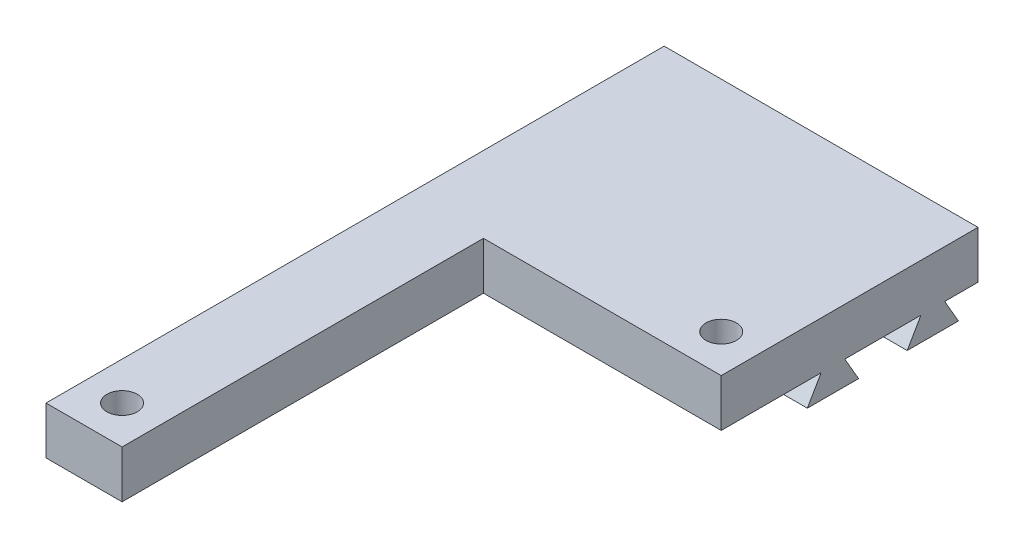
ISO-10303-21;
HEADER;
FILE_DESCRIPTION(('STEP AP214'),'2;1');
FILE_NAME('part.step','',(''),(''),'','','');
FILE_SCHEMA(('AUTOMOTIVE_DESIGN { 1 0 10303 214 1 1 1 1 }'));
ENDSEC;
DATA;
#1=APPLICATION_CONTEXT('core data for automotive mechanical design processes');
#2=APPLICATION_PROTOCOL_DEFINITION('international standard','automotive_design',2000,#1);
#3=PRODUCT_CONTEXT('',#1,'mechanical');
#4=PRODUCT('Part','Part','',(#3));
#5=PRODUCT_RELATED_PRODUCT_CATEGORY('part','',(#4));
#6=PRODUCT_DEFINITION_FORMATION('','',#4);
#7=PRODUCT_DEFINITION_CONTEXT('part definition',#1,'design');
#8=PRODUCT_DEFINITION('design','',#6,#7);
#9=PRODUCT_DEFINITION_SHAPE('','',#8);
#10=(LENGTH_UNIT() NAMED_UNIT(*) SI_UNIT(.MILLI.,.METRE.));
#11=(NAMED_UNIT(*) PLANE_ANGLE_UNIT() SI_UNIT($,.RADIAN.));
#12=(NAMED_UNIT(*) SI_UNIT($,.STERADIAN.) SOLID_ANGLE_UNIT());
#13=UNCERTAINTY_MEASURE_WITH_UNIT(LENGTH_MEASURE(1.E-05),#10,'distance_accuracy_value','');
#14=(GEOMETRIC_REPRESENTATION_CONTEXT(3) GLOBAL_UNCERTAINTY_ASSIGNED_CONTEXT((#13)) GLOBAL_UNIT_ASSIGNED_CONTEXT((#10,
#11,#12)) REPRESENTATION_CONTEXT('',''));
#15=CARTESIAN_POINT('',(0.,0.,0.));
#16=DIRECTION('',(0.,0.,1.));
#17=DIRECTION('',(1.,0.,0.));
#18=AXIS2_PLACEMENT_3D('',#15,#16,#17);
#19=CARTESIAN_POINT('',(0.,0.,0.));
#20=DIRECTION('',(0.,1.,0.));
#21=DIRECTION('',(0.,0.,1.));
#22=AXIS2_PLACEMENT_3D('',#19,#20,#21);
#23=PLANE('',#22);
#24=DIRECTION('',(0.,0.,-1.));
#25=VECTOR('',#24,1.);
#26=CARTESIAN_POINT('',(-16.5,0.,0.));
#27=LINE('',#26,#25);
#28=CARTESIAN_POINT('',(-16.5,0.,-16.));
#29=VERTEX_POINT('',#28);
#30=CARTESIAN_POINT('',(-16.5,0.,-24.));
#31=VERTEX_POINT('',#30);
#32=EDGE_CURVE('E158',#29,#31,#27,.T.);
#33=ORIENTED_EDGE('',*,*,#32,.T.);
#34=DIRECTION('',(1.,0.,0.));
#35=VECTOR('',#34,1.);
#36=CARTESIAN_POINT('',(-16.5,0.,-24.));
#37=LINE('',#36,#35);
#38=CARTESIAN_POINT('',(16.5,0.,-24.));
#39=VERTEX_POINT('',#38);
#40=EDGE_CURVE('E65',#31,#39,#37,.T.);
#41=ORIENTED_EDGE('',*,*,#40,.T.);
#42=DIRECTION('',(0.,0.,-1.));
#43=VECTOR('',#42,1.);
#44=CARTESIAN_POINT('',(16.5,0.,0.));
#45=LINE('',#44,#43);
#46=CARTESIAN_POINT('',(16.5,0.,-16.));
#47=VERTEX_POINT('',#46);
#48=EDGE_CURVE('E293',#47,#39,#45,.T.);
#49=ORIENTED_EDGE('',*,*,#48,.F.);
#50=DIRECTION('',(1.,0.,0.));
#51=VECTOR('',#50,1.);
#52=CARTESIAN_POINT('',(-16.5,0.,-16.));
#53=LINE('',#52,#51);
#54=EDGE_CURVE('E252',#29,#47,#53,.T.);
#55=ORIENTED_EDGE('',*,*,#54,.F.);
#56=EDGE_LOOP('',(#33,#41,#49,#55));
#57=FACE_BOUND('',#56,.T.);
#58=ADVANCED_FACE('F41',(#57),#23,.F.);
#59=CARTESIAN_POINT('',(16.5,0.,-26.5));
#60=VERTEX_POINT('',#59);
#61=CARTESIAN_POINT('',(16.5,0.,-30.));
#62=VERTEX_POINT('',#61);
#63=EDGE_CURVE('E57',#60,#62,#45,.T.);
#64=ORIENTED_EDGE('',*,*,#63,.F.);
#65=DIRECTION('',(1.,0.,0.));
#66=VECTOR('',#65,1.);
#67=CARTESIAN_POINT('',(-16.5,0.,-26.5));
#68=LINE('',#67,#66);
#69=CARTESIAN_POINT('',(-16.5,0.,-26.5));
#70=VERTEX_POINT('',#69);
#71=EDGE_CURVE('E213',#70,#60,#68,.T.);
#72=ORIENTED_EDGE('',*,*,#71,.F.);
#73=CARTESIAN_POINT('',(-16.5,0.,-30.));
#74=VERTEX_POINT('',#73);
#75=EDGE_CURVE('E160',#70,#74,#27,.T.);
#76=ORIENTED_EDGE('',*,*,#75,.T.);
#77=DIRECTION('',(1.,0.,0.));
#78=VECTOR('',#77,1.);
#79=CARTESIAN_POINT('',(0.,0.,-30.));
#80=LINE('',#79,#78);
#81=EDGE_CURVE('E292',#74,#62,#80,.T.);
#82=ORIENTED_EDGE('',*,*,#81,.T.);
#83=EDGE_LOOP('',(#64,#72,#76,#82));
#84=FACE_BOUND('',#83,.T.);
#85=ADVANCED_FACE('F303',(#84),#23,.F.);
#86=CARTESIAN_POINT('',(-8.49999999999999,5.,0.));
#87=DIRECTION('',(1.,0.,0.));
#88=DIRECTION('',(0.,0.,-1.));
#89=AXIS2_PLACEMENT_3D('',#86,#87,#88);
#90=PLANE('',#89);
#91=DIRECTION('',(0.,-1.,0.));
#92=VECTOR('',#91,1.);
#93=CARTESIAN_POINT('',(-8.49999999999999,5.,-2.99999999999999));
#94=LINE('',#93,#92);
#95=CARTESIAN_POINT('',(-8.49999999999999,5.,-2.99999999999999));
#96=VERTEX_POINT('',#95);
#97=CARTESIAN_POINT('',(-8.49999999999999,0.,-2.99999999999999));
#98=VERTEX_POINT('',#97);
#99=EDGE_CURVE('E191',#96,#98,#94,.T.);
#100=ORIENTED_EDGE('',*,*,#99,.F.);
#101=DIRECTION('',(0.,0.,1.));
#102=VECTOR('',#101,1.);
#103=CARTESIAN_POINT('',(-8.49999999999999,5.,0.));
#104=LINE('',#103,#102);
#105=CARTESIAN_POINT('',(-8.49999999999999,5.,35.));
#106=VERTEX_POINT('',#105);
#107=EDGE_CURVE('E157',#96,#106,#104,.T.);
#108=ORIENTED_EDGE('',*,*,#107,.T.);
#109=DIRECTION('',(0.,1.,0.));
#110=VECTOR('',#109,1.);
#111=CARTESIAN_POINT('',(-8.49999999999999,5.,35.));
#112=LINE('',#111,#110);
#113=CARTESIAN_POINT('',(-8.49999999999999,0.,35.));
#114=VERTEX_POINT('',#113);
#115=EDGE_CURVE('E170',#114,#106,#112,.T.);
#116=ORIENTED_EDGE('',*,*,#115,.F.);
#117=DIRECTION('',(0.,0.,1.));
#118=VECTOR('',#117,1.);
#119=CARTESIAN_POINT('',(-8.49999999999999,0.,0.));
#120=LINE('',#119,#118);
#121=EDGE_CURVE('E165',#98,#114,#120,.T.);
#122=ORIENTED_EDGE('',*,*,#121,.F.);
#123=EDGE_LOOP('',(#100,#108,#116,#122));
#124=FACE_BOUND('',#123,.T.);
#125=ADVANCED_FACE('F43',(#124),#90,.T.);
#126=CARTESIAN_POINT('',(16.5,5.,0.));
#127=DIRECTION('',(-1.,0.,0.));
#128=DIRECTION('',(0.,0.,1.));
#129=AXIS2_PLACEMENT_3D('',#126,#127,#128);
#130=PLANE('',#129);
#131=CARTESIAN_POINT('',(16.5,0.,-2.99999999999999));
#132=VERTEX_POINT('',#131);
#133=CARTESIAN_POINT('',(16.5,0.,-13.5));
#134=VERTEX_POINT('',#133);
#135=EDGE_CURVE('E288',#132,#134,#45,.T.);
#136=ORIENTED_EDGE('',*,*,#135,.T.);
#137=DIRECTION('',(0.,0.866025403784436,-0.500000000000005));
#138=VECTOR('',#137,1.);
#139=CARTESIAN_POINT('',(16.5,-5.84567147554499,-10.1249999999999));
#140=LINE('',#139,#138);
#141=CARTESIAN_POINT('',(16.5,-2.5,-12.0566243270259));
#142=VERTEX_POINT('',#141);
#143=EDGE_CURVE('E256',#142,#134,#140,.T.);
#144=ORIENTED_EDGE('',*,*,#143,.F.);
#145=DIRECTION('',(0.,0.,1.));
#146=VECTOR('',#145,1.);
#147=CARTESIAN_POINT('',(16.5,-2.5,0.));
#148=LINE('',#147,#146);
#149=CARTESIAN_POINT('',(16.5,-2.5,-17.4433756729741));
#150=VERTEX_POINT('',#149);
#151=EDGE_CURVE('E246',#150,#142,#148,.T.);
#152=ORIENTED_EDGE('',*,*,#151,.F.);
#153=DIRECTION('',(0.,-0.866025403784436,-0.500000000000004));
#154=VECTOR('',#153,1.);
#155=CARTESIAN_POINT('',(16.5,6.92820323027554,-11.9999999999999));
#156=LINE('',#155,#154);
#157=EDGE_CURVE('E231',#47,#150,#156,.T.);
#158=ORIENTED_EDGE('',*,*,#157,.F.);
#159=ORIENTED_EDGE('',*,*,#48,.T.);
#160=DIRECTION('',(0.,-0.866025403784436,0.500000000000004));
#161=VECTOR('',#160,1.);
#162=CARTESIAN_POINT('',(16.5,0.,-24.));
#163=LINE('',#162,#161);
#164=CARTESIAN_POINT('',(16.5,-2.5,-22.5566243270259));
#165=VERTEX_POINT('',#164);
#166=EDGE_CURVE('E227',#39,#165,#163,.T.);
#167=ORIENTED_EDGE('',*,*,#166,.T.);
#168=DIRECTION('',(0.,0.,-1.));
#169=VECTOR('',#168,1.);
#170=CARTESIAN_POINT('',(16.5,-2.5,-22.5566243270259));
#171=LINE('',#170,#169);
#172=CARTESIAN_POINT('',(16.5,-2.5,-27.9433756729741));
#173=VERTEX_POINT('',#172);
#174=EDGE_CURVE('E222',#165,#173,#171,.T.);
#175=ORIENTED_EDGE('',*,*,#174,.T.);
#176=DIRECTION('',(0.,0.866025403784436,0.500000000000005));
#177=VECTOR('',#176,1.);
#178=CARTESIAN_POINT('',(16.5,-2.5,-27.9433756729741));
#179=LINE('',#178,#177);
#180=EDGE_CURVE('E218',#173,#60,#179,.T.);
#181=ORIENTED_EDGE('',*,*,#180,.T.);
#182=ORIENTED_EDGE('',*,*,#63,.T.);
#183=DIRECTION('',(0.,-1.,0.));
#184=VECTOR('',#183,1.);
#185=CARTESIAN_POINT('',(16.5,5.,-30.));
#186=LINE('',#185,#184);
#187=CARTESIAN_POINT('',(16.5,5.,-30.));
#188=VERTEX_POINT('',#187);
#189=EDGE_CURVE('E11',#188,#62,#186,.T.);
#190=ORIENTED_EDGE('',*,*,#189,.F.);
#191=DIRECTION('',(0.,0.,-1.));
#192=VECTOR('',#191,1.);
#193=CARTESIAN_POINT('',(16.5,5.,0.));
#194=LINE('',#193,#192);
#195=CARTESIAN_POINT('',(16.5,5.,-2.99999999999999));
#196=VERTEX_POINT('',#195);
#197=EDGE_CURVE('E276',#196,#188,#194,.T.);
#198=ORIENTED_EDGE('',*,*,#197,.F.);
#199=DIRECTION('',(0.,1.,0.));
#200=VECTOR('',#199,1.);
#201=CARTESIAN_POINT('',(16.5,5.,-2.99999999999999));
#202=LINE('',#201,#200);
#203=EDGE_CURVE('E199',#132,#196,#202,.T.);
#204=ORIENTED_EDGE('',*,*,#203,.F.);
#205=EDGE_LOOP('',(#136,#144,#152,#158,#159,#167,#175,#181,#182,#190,#198,#204));
#206=FACE_BOUND('',#205,.T.);
#207=ADVANCED_FACE('F318',(#206),#130,.F.);
#208=CARTESIAN_POINT('',(0.,5.,-30.));
#209=DIRECTION('',(0.,0.,-1.));
#210=DIRECTION('',(-1.,0.,0.));
#211=AXIS2_PLACEMENT_3D('',#208,#209,#210);
#212=PLANE('',#211);
#213=ORIENTED_EDGE('',*,*,#81,.F.);
#214=DIRECTION('',(0.,-1.,0.));
#215=VECTOR('',#214,1.);
#216=CARTESIAN_POINT('',(-16.5,5.,-30.));
#217=LINE('',#216,#215);
#218=CARTESIAN_POINT('',(-16.5,5.,-30.));
#219=VERTEX_POINT('',#218);
#220=EDGE_CURVE('E50',#219,#74,#217,.T.);
#221=ORIENTED_EDGE('',*,*,#220,.F.);
#222=DIRECTION('',(1.,0.,0.));
#223=VECTOR('',#222,1.);
#224=CARTESIAN_POINT('',(0.,5.,-30.));
#225=LINE('',#224,#223);
#226=EDGE_CURVE('E279',#219,#188,#225,.T.);
#227=ORIENTED_EDGE('',*,*,#226,.T.);
#228=ORIENTED_EDGE('',*,*,#189,.T.);
#229=EDGE_LOOP('',(#213,#221,#227,#228));
#230=FACE_BOUND('',#229,.T.);
#231=ADVANCED_FACE('F301',(#230),#212,.T.);
#232=CARTESIAN_POINT('',(-16.5,5.,0.));
#233=DIRECTION('',(-1.,0.,0.));
#234=DIRECTION('',(0.,0.,1.));
#235=AXIS2_PLACEMENT_3D('',#232,#233,#234);
#236=PLANE('',#235);
#237=CARTESIAN_POINT('',(-16.5,0.,35.));
#238=VERTEX_POINT('',#237);
#239=CARTESIAN_POINT('',(-16.5,0.,-13.5));
#240=VERTEX_POINT('',#239);
#241=EDGE_CURVE('E145',#238,#240,#27,.T.);
#242=ORIENTED_EDGE('',*,*,#241,.F.);
#243=DIRECTION('',(0.,-1.,0.));
#244=VECTOR('',#243,1.);
#245=CARTESIAN_POINT('',(-16.5,5.,35.));
#246=LINE('',#245,#244);
#247=CARTESIAN_POINT('',(-16.5,5.,35.));
#248=VERTEX_POINT('',#247);
#249=EDGE_CURVE('E150',#248,#238,#246,.T.);
#250=ORIENTED_EDGE('',*,*,#249,.F.);
#251=DIRECTION('',(0.,0.,-1.));
#252=VECTOR('',#251,1.);
#253=CARTESIAN_POINT('',(-16.5,5.,0.));
#254=LINE('',#253,#252);
#255=EDGE_CURVE('E283',#248,#219,#254,.T.);
#256=ORIENTED_EDGE('',*,*,#255,.T.);
#257=ORIENTED_EDGE('',*,*,#220,.T.);
#258=ORIENTED_EDGE('',*,*,#75,.F.);
#259=DIRECTION('',(0.,0.866025403784436,0.500000000000005));
#260=VECTOR('',#259,1.);
#261=CARTESIAN_POINT('',(-16.5,-2.5,-27.9433756729741));
#262=LINE('',#261,#260);
#263=CARTESIAN_POINT('',(-16.5,-2.5,-27.9433756729741));
#264=VERTEX_POINT('',#263);
#265=EDGE_CURVE('E209',#264,#70,#262,.T.);
#266=ORIENTED_EDGE('',*,*,#265,.F.);
#267=DIRECTION('',(0.,0.,-1.));
#268=VECTOR('',#267,1.);
#269=CARTESIAN_POINT('',(-16.5,-2.5,-22.5566243270259));
#270=LINE('',#269,#268);
#271=CARTESIAN_POINT('',(-16.5,-2.5,-22.5566243270259));
#272=VERTEX_POINT('',#271);
#273=EDGE_CURVE('E235',#272,#264,#270,.T.);
#274=ORIENTED_EDGE('',*,*,#273,.F.);
#275=DIRECTION('',(0.,-0.866025403784436,0.500000000000004));
#276=VECTOR('',#275,1.);
#277=CARTESIAN_POINT('',(-16.5,0.,-24.));
#278=LINE('',#277,#276);
#279=EDGE_CURVE('E223',#31,#272,#278,.T.);
#280=ORIENTED_EDGE('',*,*,#279,.F.);
#281=ORIENTED_EDGE('',*,*,#32,.F.);
#282=DIRECTION('',(0.,-0.866025403784436,-0.500000000000004));
#283=VECTOR('',#282,1.);
#284=CARTESIAN_POINT('',(-16.5,6.92820323027554,-11.9999999999999));
#285=LINE('',#284,#283);
#286=CARTESIAN_POINT('',(-16.5,-2.5,-17.4433756729741));
#287=VERTEX_POINT('',#286);
#288=EDGE_CURVE('E242',#29,#287,#285,.T.);
#289=ORIENTED_EDGE('',*,*,#288,.T.);
#290=DIRECTION('',(0.,0.,1.));
#291=VECTOR('',#290,1.);
#292=CARTESIAN_POINT('',(-16.5,-2.5,0.));
#293=LINE('',#292,#291);
#294=CARTESIAN_POINT('',(-16.5,-2.5,-12.0566243270259));
#295=VERTEX_POINT('',#294);
#296=EDGE_CURVE('E249',#287,#295,#293,.T.);
#297=ORIENTED_EDGE('',*,*,#296,.T.);
#298=DIRECTION('',(0.,0.866025403784436,-0.500000000000005));
#299=VECTOR('',#298,1.);
#300=CARTESIAN_POINT('',(-16.5,-5.84567147554499,-10.1249999999999));
#301=LINE('',#300,#299);
#302=EDGE_CURVE('E152',#295,#240,#301,.T.);
#303=ORIENTED_EDGE('',*,*,#302,.T.);
#304=EDGE_LOOP('',(#242,#250,#256,#257,#258,#266,#274,#280,#281,#289,#297,#303));
#305=FACE_BOUND('',#304,.T.);
#306=ADVANCED_FACE('F147',(#305),#236,.T.);
#307=CARTESIAN_POINT('',(0.,5.,0.));
#308=DIRECTION('',(0.,1.,0.));
#309=DIRECTION('',(0.,0.,1.));
#310=AXIS2_PLACEMENT_3D('',#307,#308,#309);
#311=PLANE('',#310);
#312=CARTESIAN_POINT('',(12.5,5.,-6.99999999999999));
#313=DIRECTION('',(0.,1.,0.));
#314=DIRECTION('',(0.,0.,1.));
#315=AXIS2_PLACEMENT_3D('',#312,#313,#314);
#316=CIRCLE('',#315,1.6);
#317=CARTESIAN_POINT('',(12.5,5.,-5.39999999999999));
#318=VERTEX_POINT('',#317);
#319=EDGE_CURVE('E181',#318,#318,#316,.T.);
#320=ORIENTED_EDGE('',*,*,#319,.F.);
#321=EDGE_LOOP('',(#320));
#322=FACE_BOUND('',#321,.T.);
#323=CARTESIAN_POINT('',(-12.5,5.,31.));
#324=DIRECTION('',(0.,1.,0.));
#325=DIRECTION('',(0.,0.,1.));
#326=AXIS2_PLACEMENT_3D('',#323,#324,#325);
#327=CIRCLE('',#326,1.6);
#328=CARTESIAN_POINT('',(-12.5,5.,32.6));
#329=VERTEX_POINT('',#328);
#330=EDGE_CURVE('E184',#329,#329,#327,.T.);
#331=ORIENTED_EDGE('',*,*,#330,.F.);
#332=EDGE_LOOP('',(#331));
#333=FACE_BOUND('',#332,.T.);
#334=ORIENTED_EDGE('',*,*,#107,.F.);
#335=DIRECTION('',(-1.,0.,0.));
#336=VECTOR('',#335,1.);
#337=CARTESIAN_POINT('',(-8.49999999999999,5.,-2.99999999999999));
#338=LINE('',#337,#336);
#339=EDGE_CURVE('E203',#196,#96,#338,.T.);
#340=ORIENTED_EDGE('',*,*,#339,.F.);
#341=ORIENTED_EDGE('',*,*,#197,.T.);
#342=ORIENTED_EDGE('',*,*,#226,.F.);
#343=ORIENTED_EDGE('',*,*,#255,.F.);
#344=DIRECTION('',(-1.,0.,0.));
#345=VECTOR('',#344,1.);
#346=CARTESIAN_POINT('',(-16.5,5.,35.));
#347=LINE('',#346,#345);
#348=EDGE_CURVE('E175',#106,#248,#347,.T.);
#349=ORIENTED_EDGE('',*,*,#348,.F.);
#350=EDGE_LOOP('',(#334,#340,#341,#342,#343,#349));
#351=FACE_BOUND('',#350,.T.);
#352=ADVANCED_FACE('F344',(#322,#333,#351),#311,.T.);
#353=CARTESIAN_POINT('',(12.5,0.,-6.99999999999999));
#354=DIRECTION('',(0.,1.,0.));
#355=DIRECTION('',(0.,0.,1.));
#356=AXIS2_PLACEMENT_3D('',#353,#354,#355);
#357=CIRCLE('',#356,1.6);
#358=CARTESIAN_POINT('',(12.5,0.,-5.39999999999999));
#359=VERTEX_POINT('',#358);
#360=EDGE_CURVE('E177',#359,#359,#357,.T.);
#361=ORIENTED_EDGE('',*,*,#360,.T.);
#362=EDGE_LOOP('',(#361));
#363=FACE_BOUND('',#362,.T.);
#364=CARTESIAN_POINT('',(-12.5,0.,31.));
#365=DIRECTION('',(0.,1.,0.));
#366=DIRECTION('',(0.,0.,1.));
#367=AXIS2_PLACEMENT_3D('',#364,#365,#366);
#368=CIRCLE('',#367,1.6);
#369=CARTESIAN_POINT('',(-12.5,0.,32.6));
#370=VERTEX_POINT('',#369);
#371=EDGE_CURVE('E358',#370,#370,#368,.T.);
#372=ORIENTED_EDGE('',*,*,#371,.T.);
#373=EDGE_LOOP('',(#372));
#374=FACE_BOUND('',#373,.T.);
#375=DIRECTION('',(1.,0.,0.));
#376=VECTOR('',#375,1.);
#377=CARTESIAN_POINT('',(-8.49999999999999,0.,-2.99999999999999));
#378=LINE('',#377,#376);
#379=EDGE_CURVE('E195',#98,#132,#378,.T.);
#380=ORIENTED_EDGE('',*,*,#379,.F.);
#381=ORIENTED_EDGE('',*,*,#121,.T.);
#382=DIRECTION('',(1.,0.,0.));
#383=VECTOR('',#382,1.);
#384=CARTESIAN_POINT('',(-16.5,0.,35.));
#385=LINE('',#384,#383);
#386=EDGE_CURVE('E162',#238,#114,#385,.T.);
#387=ORIENTED_EDGE('',*,*,#386,.F.);
#388=ORIENTED_EDGE('',*,*,#241,.T.);
#389=DIRECTION('',(1.,0.,0.));
#390=VECTOR('',#389,1.);
#391=CARTESIAN_POINT('',(-16.5,0.,-13.5));
#392=LINE('',#391,#390);
#393=EDGE_CURVE('E269',#240,#134,#392,.T.);
#394=ORIENTED_EDGE('',*,*,#393,.T.);
#395=ORIENTED_EDGE('',*,*,#135,.F.);
#396=EDGE_LOOP('',(#380,#381,#387,#388,#394,#395));
#397=FACE_BOUND('',#396,.T.);
#398=ADVANCED_FACE('F163',(#363,#374,#397),#23,.F.);
#399=CARTESIAN_POINT('',(-16.5,6.92820323027554,-11.9999999999999));
#400=DIRECTION('',(0.,-0.500000000000004,0.866025403784436));
#401=DIRECTION('',(0.,-0.866025403784436,-0.500000000000004));
#402=AXIS2_PLACEMENT_3D('',#399,#400,#401);
#403=PLANE('',#402);
#404=ORIENTED_EDGE('',*,*,#157,.T.);
#405=DIRECTION('',(1.,0.,0.));
#406=VECTOR('',#405,1.);
#407=CARTESIAN_POINT('',(-16.5,-2.5,-17.4433756729741));
#408=LINE('',#407,#406);
#409=EDGE_CURVE('E261',#287,#150,#408,.T.);
#410=ORIENTED_EDGE('',*,*,#409,.F.);
#411=ORIENTED_EDGE('',*,*,#288,.F.);
#412=ORIENTED_EDGE('',*,*,#54,.T.);
#413=EDGE_LOOP('',(#404,#410,#411,#412));
#414=FACE_BOUND('',#413,.T.);
#415=ADVANCED_FACE('F343',(#414),#403,.F.);
#416=CARTESIAN_POINT('',(-16.5,-2.5,0.));
#417=DIRECTION('',(0.,1.,0.));
#418=DIRECTION('',(0.,0.,1.));
#419=AXIS2_PLACEMENT_3D('',#416,#417,#418);
#420=PLANE('',#419);
#421=ORIENTED_EDGE('',*,*,#151,.T.);
#422=DIRECTION('',(1.,0.,0.));
#423=VECTOR('',#422,1.);
#424=CARTESIAN_POINT('',(-16.5,-2.5,-12.0566243270259));
#425=LINE('',#424,#423);
#426=EDGE_CURVE('E265',#295,#142,#425,.T.);
#427=ORIENTED_EDGE('',*,*,#426,.F.);
#428=ORIENTED_EDGE('',*,*,#296,.F.);
#429=ORIENTED_EDGE('',*,*,#409,.T.);
#430=EDGE_LOOP('',(#421,#427,#428,#429));
#431=FACE_BOUND('',#430,.T.);
#432=ADVANCED_FACE('F350',(#431),#420,.F.);
#433=CARTESIAN_POINT('',(-16.5,-5.84567147554499,-10.1249999999999));
#434=DIRECTION('',(0.,-0.500000000000005,-0.866025403784436));
#435=DIRECTION('',(0.,0.866025403784436,-0.500000000000005));
#436=AXIS2_PLACEMENT_3D('',#433,#434,#435);
#437=PLANE('',#436);
#438=ORIENTED_EDGE('',*,*,#143,.T.);
#439=ORIENTED_EDGE('',*,*,#393,.F.);
#440=ORIENTED_EDGE('',*,*,#302,.F.);
#441=ORIENTED_EDGE('',*,*,#426,.T.);
#442=EDGE_LOOP('',(#438,#439,#440,#441));
#443=FACE_BOUND('',#442,.T.);
#444=ADVANCED_FACE('F332',(#443),#437,.F.);
#445=CARTESIAN_POINT('',(-16.5,0.,-24.));
#446=DIRECTION('',(0.,0.500000000000004,0.866025403784436));
#447=DIRECTION('',(0.,-0.866025403784437,0.500000000000004));
#448=AXIS2_PLACEMENT_3D('',#445,#446,#447);
#449=PLANE('',#448);
#450=ORIENTED_EDGE('',*,*,#166,.F.);
#451=ORIENTED_EDGE('',*,*,#40,.F.);
#452=ORIENTED_EDGE('',*,*,#279,.T.);
#453=DIRECTION('',(1.,0.,0.));
#454=VECTOR('',#453,1.);
#455=CARTESIAN_POINT('',(-16.5,-2.5,-22.5566243270259));
#456=LINE('',#455,#454);
#457=EDGE_CURVE('E206',#272,#165,#456,.T.);
#458=ORIENTED_EDGE('',*,*,#457,.T.);
#459=EDGE_LOOP('',(#450,#451,#452,#458));
#460=FACE_BOUND('',#459,.T.);
#461=ADVANCED_FACE('F311',(#460),#449,.T.);
#462=CARTESIAN_POINT('',(-16.5,-2.5,-27.9433756729741));
#463=DIRECTION('',(0.,0.500000000000005,-0.866025403784436));
#464=DIRECTION('',(0.,0.866025403784436,0.500000000000005));
#465=AXIS2_PLACEMENT_3D('',#462,#463,#464);
#466=PLANE('',#465);
#467=ORIENTED_EDGE('',*,*,#180,.F.);
#468=DIRECTION('',(1.,0.,0.));
#469=VECTOR('',#468,1.);
#470=CARTESIAN_POINT('',(-16.5,-2.5,-27.9433756729741));
#471=LINE('',#470,#469);
#472=EDGE_CURVE('E210',#264,#173,#471,.T.);
#473=ORIENTED_EDGE('',*,*,#472,.F.);
#474=ORIENTED_EDGE('',*,*,#265,.T.);
#475=ORIENTED_EDGE('',*,*,#71,.T.);
#476=EDGE_LOOP('',(#467,#473,#474,#475));
#477=FACE_BOUND('',#476,.T.);
#478=ADVANCED_FACE('F323',(#477),#466,.T.);
#479=CARTESIAN_POINT('',(-16.5,-2.5,-22.5566243270259));
#480=DIRECTION('',(0.,-1.,0.));
#481=DIRECTION('',(0.,0.,-1.));
#482=AXIS2_PLACEMENT_3D('',#479,#480,#481);
#483=PLANE('',#482);
#484=ORIENTED_EDGE('',*,*,#174,.F.);
#485=ORIENTED_EDGE('',*,*,#457,.F.);
#486=ORIENTED_EDGE('',*,*,#273,.T.);
#487=ORIENTED_EDGE('',*,*,#472,.T.);
#488=EDGE_LOOP('',(#484,#485,#486,#487));
#489=FACE_BOUND('',#488,.T.);
#490=ADVANCED_FACE('F315',(#489),#483,.T.);
#491=CARTESIAN_POINT('',(0.,0.,-2.99999999999999));
#492=DIRECTION('',(0.,0.,1.));
#493=DIRECTION('',(1.,0.,0.));
#494=AXIS2_PLACEMENT_3D('',#491,#492,#493);
#495=PLANE('',#494);
#496=ORIENTED_EDGE('',*,*,#99,.T.);
#497=ORIENTED_EDGE('',*,*,#379,.T.);
#498=ORIENTED_EDGE('',*,*,#203,.T.);
#499=ORIENTED_EDGE('',*,*,#339,.T.);
#500=EDGE_LOOP('',(#496,#497,#498,#499));
#501=FACE_BOUND('',#500,.T.);
#502=ADVANCED_FACE('F330',(#501),#495,.T.);
#503=CARTESIAN_POINT('',(0.,0.,35.));
#504=DIRECTION('',(0.,0.,1.));
#505=DIRECTION('',(1.,0.,0.));
#506=AXIS2_PLACEMENT_3D('',#503,#504,#505);
#507=PLANE('',#506);
#508=ORIENTED_EDGE('',*,*,#249,.T.);
#509=ORIENTED_EDGE('',*,*,#386,.T.);
#510=ORIENTED_EDGE('',*,*,#115,.T.);
#511=ORIENTED_EDGE('',*,*,#348,.T.);
#512=EDGE_LOOP('',(#508,#509,#510,#511));
#513=FACE_BOUND('',#512,.T.);
#514=ADVANCED_FACE('F173',(#513),#507,.T.);
#515=CARTESIAN_POINT('',(-12.5,0.,31.));
#516=DIRECTION('',(0.,1.,0.));
#517=DIRECTION('',(0.,0.,1.));
#518=AXIS2_PLACEMENT_3D('',#515,#516,#517);
#519=CYLINDRICAL_SURFACE('',#518,1.6);
#520=ORIENTED_EDGE('',*,*,#371,.F.);
#521=EDGE_LOOP('',(#520));
#522=FACE_BOUND('',#521,.T.);
#523=ORIENTED_EDGE('',*,*,#330,.T.);
#524=EDGE_LOOP('',(#523));
#525=FACE_BOUND('',#524,.T.);
#526=ADVANCED_FACE('F368',(#522,#525),#519,.F.);
#527=CARTESIAN_POINT('',(12.5,0.,-6.99999999999999));
#528=DIRECTION('',(0.,1.,0.));
#529=DIRECTION('',(0.,0.,1.));
#530=AXIS2_PLACEMENT_3D('',#527,#528,#529);
#531=CYLINDRICAL_SURFACE('',#530,1.6);
#532=ORIENTED_EDGE('',*,*,#360,.F.);
#533=EDGE_LOOP('',(#532));
#534=FACE_BOUND('',#533,.T.);
#535=ORIENTED_EDGE('',*,*,#319,.T.);
#536=EDGE_LOOP('',(#535));
#537=FACE_BOUND('',#536,.T.);
#538=ADVANCED_FACE('F465',(#534,#537),#531,.F.);
#539=CLOSED_SHELL('',(#58,#85,#125,#207,#231,#306,#352,#398,#415,#432,#444,#461,#478,#490,#502,
#514,#526,#538));
#540=MANIFOLD_SOLID_BREP('B2',#539);
#541=ADVANCED_BREP_SHAPE_REPRESENTATION('',(#18,#540),#14);
#542=SHAPE_DEFINITION_REPRESENTATION(#9,#541);
ENDSEC;
END-ISO-10303-21;
